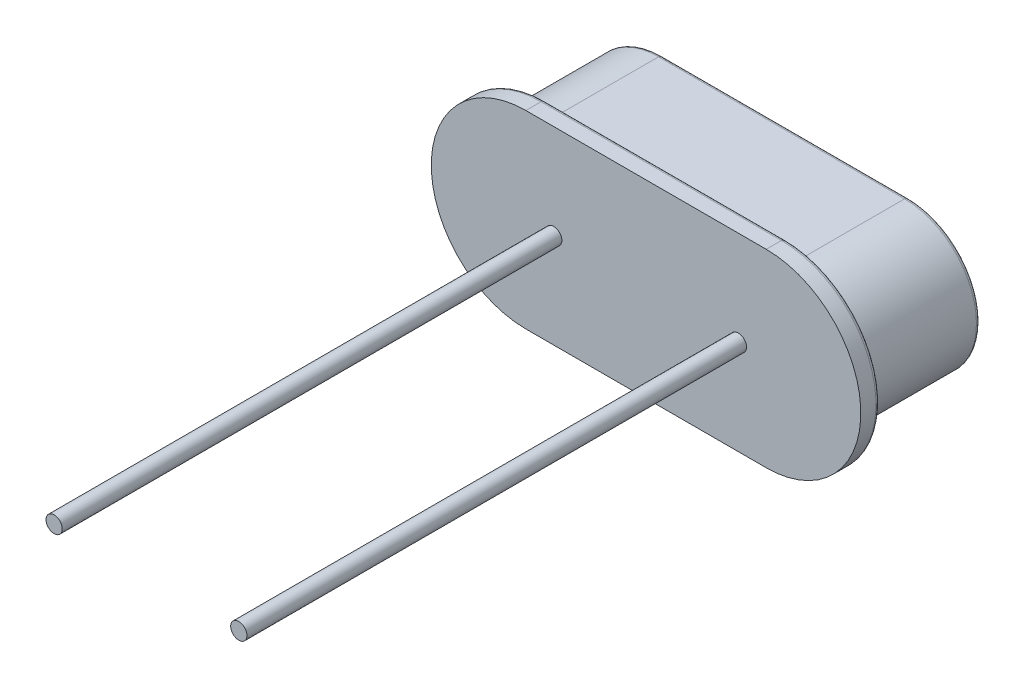
ISO-10303-21;
HEADER;
FILE_DESCRIPTION(('STEP AP214'),'2;1');
FILE_NAME('part.step','',(''),(''),'','','');
FILE_SCHEMA(('AUTOMOTIVE_DESIGN { 1 0 10303 214 1 1 1 1 }'));
ENDSEC;
DATA;
#1=APPLICATION_CONTEXT('core data for automotive mechanical design processes');
#2=APPLICATION_PROTOCOL_DEFINITION('international standard','automotive_design',2000,#1);
#3=PRODUCT_CONTEXT('',#1,'mechanical');
#4=PRODUCT('Part','Part','',(#3));
#5=PRODUCT_RELATED_PRODUCT_CATEGORY('part','',(#4));
#6=PRODUCT_DEFINITION_FORMATION('','',#4);
#7=PRODUCT_DEFINITION_CONTEXT('part definition',#1,'design');
#8=PRODUCT_DEFINITION('design','',#6,#7);
#9=PRODUCT_DEFINITION_SHAPE('','',#8);
#10=(LENGTH_UNIT() NAMED_UNIT(*) SI_UNIT(.MILLI.,.METRE.));
#11=(NAMED_UNIT(*) PLANE_ANGLE_UNIT() SI_UNIT($,.RADIAN.));
#12=(NAMED_UNIT(*) SI_UNIT($,.STERADIAN.) SOLID_ANGLE_UNIT());
#13=UNCERTAINTY_MEASURE_WITH_UNIT(LENGTH_MEASURE(1.E-05),#10,'distance_accuracy_value','');
#14=(GEOMETRIC_REPRESENTATION_CONTEXT(3) GLOBAL_UNCERTAINTY_ASSIGNED_CONTEXT((#13)) GLOBAL_UNIT_ASSIGNED_CONTEXT((#10,
#11,#12)) REPRESENTATION_CONTEXT('',''));
#15=CARTESIAN_POINT('',(0.,0.,0.));
#16=DIRECTION('',(0.,0.,1.));
#17=DIRECTION('',(1.,0.,0.));
#18=AXIS2_PLACEMENT_3D('',#15,#16,#17);
#19=CARTESIAN_POINT('',(-3.175,0.,0.));
#20=DIRECTION('',(0.,0.,1.));
#21=DIRECTION('',(1.,0.,0.));
#22=AXIS2_PLACEMENT_3D('',#19,#20,#21);
#23=PLANE('',#22);
#24=CARTESIAN_POINT('',(-2.44,0.,0.));
#25=DIRECTION('',(0.,0.,1.));
#26=DIRECTION('',(1.,0.,0.));
#27=AXIS2_PLACEMENT_3D('',#24,#25,#26);
#28=CIRCLE('',#27,0.215);
#29=CARTESIAN_POINT('',(-2.225,0.,0.));
#30=VERTEX_POINT('',#29);
#31=EDGE_CURVE('E314',#30,#30,#28,.T.);
#32=ORIENTED_EDGE('',*,*,#31,.F.);
#33=EDGE_LOOP('',(#32));
#34=FACE_BOUND('',#33,.T.);
#35=CARTESIAN_POINT('',(-3.175,0.,0.));
#36=DIRECTION('',(0.,0.,1.));
#37=DIRECTION('',(1.,0.,0.));
#38=AXIS2_PLACEMENT_3D('',#35,#36,#37);
#39=CIRCLE('',#38,2.5);
#40=CARTESIAN_POINT('',(-3.175,2.5,0.));
#41=VERTEX_POINT('',#40);
#42=CARTESIAN_POINT('',(-3.175,-2.5,0.));
#43=VERTEX_POINT('',#42);
#44=EDGE_CURVE('E156',#41,#43,#39,.T.);
#45=ORIENTED_EDGE('',*,*,#44,.T.);
#46=DIRECTION('',(1.,0.,0.));
#47=VECTOR('',#46,1.);
#48=CARTESIAN_POINT('',(-3.175,-2.5,0.));
#49=LINE('',#48,#47);
#50=CARTESIAN_POINT('',(3.175,-2.5,0.));
#51=VERTEX_POINT('',#50);
#52=EDGE_CURVE('E159',#43,#51,#49,.T.);
#53=ORIENTED_EDGE('',*,*,#52,.T.);
#54=CARTESIAN_POINT('',(3.175,0.,0.));
#55=DIRECTION('',(0.,0.,1.));
#56=DIRECTION('',(1.,0.,0.));
#57=AXIS2_PLACEMENT_3D('',#54,#55,#56);
#58=CIRCLE('',#57,2.5);
#59=CARTESIAN_POINT('',(3.175,2.5,0.));
#60=VERTEX_POINT('',#59);
#61=EDGE_CURVE('E162',#51,#60,#58,.T.);
#62=ORIENTED_EDGE('',*,*,#61,.T.);
#63=DIRECTION('',(-1.,0.,0.));
#64=VECTOR('',#63,1.);
#65=CARTESIAN_POINT('',(-3.175,2.5,0.));
#66=LINE('',#65,#64);
#67=EDGE_CURVE('E165',#60,#41,#66,.T.);
#68=ORIENTED_EDGE('',*,*,#67,.T.);
#69=EDGE_LOOP('',(#45,#53,#62,#68));
#70=FACE_BOUND('',#69,.T.);
#71=CARTESIAN_POINT('',(2.44,0.,0.));
#72=DIRECTION('',(0.,0.,1.));
#73=DIRECTION('',(1.,0.,0.));
#74=AXIS2_PLACEMENT_3D('',#71,#72,#73);
#75=CIRCLE('',#74,0.215);
#76=CARTESIAN_POINT('',(2.655,0.,0.));
#77=VERTEX_POINT('',#76);
#78=EDGE_CURVE('E204',#77,#77,#75,.T.);
#79=ORIENTED_EDGE('',*,*,#78,.F.);
#80=EDGE_LOOP('',(#79));
#81=FACE_BOUND('',#80,.T.);
#82=ADVANCED_FACE('F32',(#34,#70,#81),#23,.T.);
#83=CARTESIAN_POINT('',(-3.175,0.,-0.5));
#84=DIRECTION('',(0.,0.,1.));
#85=DIRECTION('',(1.,0.,0.));
#86=AXIS2_PLACEMENT_3D('',#83,#84,#85);
#87=PLANE('',#86);
#88=CARTESIAN_POINT('',(3.175,0.,-0.5));
#89=DIRECTION('',(0.,0.,1.));
#90=DIRECTION('',(1.,0.,0.));
#91=AXIS2_PLACEMENT_3D('',#88,#89,#90);
#92=CIRCLE('',#91,2.4);
#93=CARTESIAN_POINT('',(3.175,2.4,-0.5));
#94=VERTEX_POINT('',#93);
#95=CARTESIAN_POINT('',(3.175,-2.4,-0.5));
#96=VERTEX_POINT('',#95);
#97=EDGE_CURVE('E207',#94,#96,#92,.F.);
#98=ORIENTED_EDGE('',*,*,#97,.T.);
#99=DIRECTION('',(1.,0.,0.));
#100=VECTOR('',#99,1.);
#101=CARTESIAN_POINT('',(-3.175,-2.4,-0.5));
#102=LINE('',#101,#100);
#103=CARTESIAN_POINT('',(-3.175,-2.4,-0.5));
#104=VERTEX_POINT('',#103);
#105=EDGE_CURVE('E213',#96,#104,#102,.F.);
#106=ORIENTED_EDGE('',*,*,#105,.T.);
#107=CARTESIAN_POINT('',(-3.175,0.,-0.5));
#108=DIRECTION('',(0.,0.,1.));
#109=DIRECTION('',(1.,0.,0.));
#110=AXIS2_PLACEMENT_3D('',#107,#108,#109);
#111=CIRCLE('',#110,2.4);
#112=CARTESIAN_POINT('',(-3.175,2.4,-0.5));
#113=VERTEX_POINT('',#112);
#114=EDGE_CURVE('E211',#104,#113,#111,.F.);
#115=ORIENTED_EDGE('',*,*,#114,.T.);
#116=DIRECTION('',(-1.,0.,0.));
#117=VECTOR('',#116,1.);
#118=CARTESIAN_POINT('',(3.175,2.4,-0.5));
#119=LINE('',#118,#117);
#120=EDGE_CURVE('E209',#113,#94,#119,.F.);
#121=ORIENTED_EDGE('',*,*,#120,.T.);
#122=EDGE_LOOP('',(#98,#106,#115,#121));
#123=FACE_BOUND('',#122,.T.);
#124=CARTESIAN_POINT('',(3.25,0.,-0.5));
#125=DIRECTION('',(0.,0.,-1.));
#126=DIRECTION('',(-1.,0.,0.));
#127=AXIS2_PLACEMENT_3D('',#124,#125,#126);
#128=CIRCLE('',#127,1.9);
#129=CARTESIAN_POINT('',(3.25,1.9,-0.5));
#130=VERTEX_POINT('',#129);
#131=CARTESIAN_POINT('',(3.25,-1.9,-0.5));
#132=VERTEX_POINT('',#131);
#133=EDGE_CURVE('E125',#130,#132,#128,.T.);
#134=ORIENTED_EDGE('',*,*,#133,.F.);
#135=DIRECTION('',(1.,0.,0.));
#136=VECTOR('',#135,1.);
#137=CARTESIAN_POINT('',(3.25,1.9,-0.5));
#138=LINE('',#137,#136);
#139=CARTESIAN_POINT('',(-3.25,1.9,-0.5));
#140=VERTEX_POINT('',#139);
#141=EDGE_CURVE('E132',#140,#130,#138,.T.);
#142=ORIENTED_EDGE('',*,*,#141,.F.);
#143=CARTESIAN_POINT('',(-3.25,0.,-0.5));
#144=DIRECTION('',(0.,0.,-1.));
#145=DIRECTION('',(-1.,0.,0.));
#146=AXIS2_PLACEMENT_3D('',#143,#144,#145);
#147=CIRCLE('',#146,1.9);
#148=CARTESIAN_POINT('',(-3.25,-1.9,-0.5));
#149=VERTEX_POINT('',#148);
#150=EDGE_CURVE('E146',#149,#140,#147,.T.);
#151=ORIENTED_EDGE('',*,*,#150,.F.);
#152=DIRECTION('',(-1.,0.,0.));
#153=VECTOR('',#152,1.);
#154=CARTESIAN_POINT('',(3.25,-1.9,-0.5));
#155=LINE('',#154,#153);
#156=EDGE_CURVE('E141',#132,#149,#155,.T.);
#157=ORIENTED_EDGE('',*,*,#156,.F.);
#158=EDGE_LOOP('',(#134,#142,#151,#157));
#159=FACE_BOUND('',#158,.T.);
#160=ADVANCED_FACE('F137',(#123,#159),#87,.F.);
#161=CARTESIAN_POINT('',(-3.175,0.,-0.5));
#162=DIRECTION('',(0.,0.,1.));
#163=DIRECTION('',(1.,0.,0.));
#164=AXIS2_PLACEMENT_3D('',#161,#162,#163);
#165=CYLINDRICAL_SURFACE('',#164,2.5);
#166=DIRECTION('',(0.,0.,1.));
#167=VECTOR('',#166,1.);
#168=CARTESIAN_POINT('',(-3.175,2.5,-0.5));
#169=LINE('',#168,#167);
#170=CARTESIAN_POINT('',(-3.175,2.5,-0.4));
#171=VERTEX_POINT('',#170);
#172=EDGE_CURVE('E169',#171,#41,#169,.T.);
#173=ORIENTED_EDGE('',*,*,#172,.F.);
#174=CARTESIAN_POINT('',(-3.175,0.,-0.4));
#175=DIRECTION('',(0.,0.,1.));
#176=DIRECTION('',(1.,0.,0.));
#177=AXIS2_PLACEMENT_3D('',#174,#175,#176);
#178=CIRCLE('',#177,2.5);
#179=CARTESIAN_POINT('',(-3.175,-2.5,-0.4));
#180=VERTEX_POINT('',#179);
#181=EDGE_CURVE('E216',#171,#180,#178,.T.);
#182=ORIENTED_EDGE('',*,*,#181,.T.);
#183=DIRECTION('',(0.,0.,1.));
#184=VECTOR('',#183,1.);
#185=CARTESIAN_POINT('',(-3.175,-2.5,-0.5));
#186=LINE('',#185,#184);
#187=EDGE_CURVE('E168',#180,#43,#186,.T.);
#188=ORIENTED_EDGE('',*,*,#187,.T.);
#189=ORIENTED_EDGE('',*,*,#44,.F.);
#190=EDGE_LOOP('',(#173,#182,#188,#189));
#191=FACE_BOUND('',#190,.T.);
#192=ADVANCED_FACE('F254',(#191),#165,.T.);
#193=CARTESIAN_POINT('',(-3.175,2.5,-0.5));
#194=DIRECTION('',(0.,1.,0.));
#195=DIRECTION('',(-1.,0.,0.));
#196=AXIS2_PLACEMENT_3D('',#193,#194,#195);
#197=PLANE('',#196);
#198=DIRECTION('',(0.,0.,1.));
#199=VECTOR('',#198,1.);
#200=CARTESIAN_POINT('',(3.175,2.5,-0.5));
#201=LINE('',#200,#199);
#202=CARTESIAN_POINT('',(3.175,2.5,-0.4));
#203=VERTEX_POINT('',#202);
#204=EDGE_CURVE('E172',#203,#60,#201,.T.);
#205=ORIENTED_EDGE('',*,*,#204,.F.);
#206=DIRECTION('',(-1.,0.,0.));
#207=VECTOR('',#206,1.);
#208=CARTESIAN_POINT('',(-3.175,2.5,-0.4));
#209=LINE('',#208,#207);
#210=EDGE_CURVE('E41',#203,#171,#209,.T.);
#211=ORIENTED_EDGE('',*,*,#210,.T.);
#212=ORIENTED_EDGE('',*,*,#172,.T.);
#213=ORIENTED_EDGE('',*,*,#67,.F.);
#214=EDGE_LOOP('',(#205,#211,#212,#213));
#215=FACE_BOUND('',#214,.T.);
#216=ADVANCED_FACE('F255',(#215),#197,.T.);
#217=CARTESIAN_POINT('',(3.175,0.,-0.5));
#218=DIRECTION('',(0.,0.,1.));
#219=DIRECTION('',(1.,0.,0.));
#220=AXIS2_PLACEMENT_3D('',#217,#218,#219);
#221=CYLINDRICAL_SURFACE('',#220,2.5);
#222=DIRECTION('',(0.,0.,1.));
#223=VECTOR('',#222,1.);
#224=CARTESIAN_POINT('',(3.175,-2.5,-0.5));
#225=LINE('',#224,#223);
#226=CARTESIAN_POINT('',(3.175,-2.5,-0.4));
#227=VERTEX_POINT('',#226);
#228=EDGE_CURVE('E174',#227,#51,#225,.T.);
#229=ORIENTED_EDGE('',*,*,#228,.F.);
#230=CARTESIAN_POINT('',(3.175,0.,-0.4));
#231=DIRECTION('',(0.,0.,1.));
#232=DIRECTION('',(1.,0.,0.));
#233=AXIS2_PLACEMENT_3D('',#230,#231,#232);
#234=CIRCLE('',#233,2.5);
#235=EDGE_CURVE('E11',#227,#203,#234,.T.);
#236=ORIENTED_EDGE('',*,*,#235,.T.);
#237=ORIENTED_EDGE('',*,*,#204,.T.);
#238=ORIENTED_EDGE('',*,*,#61,.F.);
#239=EDGE_LOOP('',(#229,#236,#237,#238));
#240=FACE_BOUND('',#239,.T.);
#241=ADVANCED_FACE('F248',(#240),#221,.T.);
#242=CARTESIAN_POINT('',(-3.175,-2.5,-0.5));
#243=DIRECTION('',(0.,-1.,0.));
#244=DIRECTION('',(1.,0.,0.));
#245=AXIS2_PLACEMENT_3D('',#242,#243,#244);
#246=PLANE('',#245);
#247=ORIENTED_EDGE('',*,*,#187,.F.);
#248=DIRECTION('',(1.,0.,0.));
#249=VECTOR('',#248,1.);
#250=CARTESIAN_POINT('',(3.175,-2.5,-0.4));
#251=LINE('',#250,#249);
#252=EDGE_CURVE('E193',#180,#227,#251,.T.);
#253=ORIENTED_EDGE('',*,*,#252,.T.);
#254=ORIENTED_EDGE('',*,*,#228,.T.);
#255=ORIENTED_EDGE('',*,*,#52,.F.);
#256=EDGE_LOOP('',(#247,#253,#254,#255));
#257=FACE_BOUND('',#256,.T.);
#258=ADVANCED_FACE('F245',(#257),#246,.T.);
#259=CARTESIAN_POINT('',(3.25,0.,-3.68));
#260=DIRECTION('',(0.,0.,1.));
#261=DIRECTION('',(1.,0.,0.));
#262=AXIS2_PLACEMENT_3D('',#259,#260,#261);
#263=CYLINDRICAL_SURFACE('',#262,1.9);
#264=DIRECTION('',(0.,0.,1.));
#265=VECTOR('',#264,1.);
#266=CARTESIAN_POINT('',(3.25,-1.9,-3.68));
#267=LINE('',#266,#265);
#268=CARTESIAN_POINT('',(3.25,-1.9,-3.58));
#269=VERTEX_POINT('',#268);
#270=EDGE_CURVE('E154',#269,#132,#267,.T.);
#271=ORIENTED_EDGE('',*,*,#270,.F.);
#272=CARTESIAN_POINT('',(3.25,0.,-3.58));
#273=DIRECTION('',(0.,0.,-1.));
#274=DIRECTION('',(-1.,0.,0.));
#275=AXIS2_PLACEMENT_3D('',#272,#273,#274);
#276=CIRCLE('',#275,1.9);
#277=CARTESIAN_POINT('',(3.25,1.9,-3.58));
#278=VERTEX_POINT('',#277);
#279=EDGE_CURVE('E127',#269,#278,#276,.F.);
#280=ORIENTED_EDGE('',*,*,#279,.T.);
#281=DIRECTION('',(0.,0.,1.));
#282=VECTOR('',#281,1.);
#283=CARTESIAN_POINT('',(3.25,1.9,-3.68));
#284=LINE('',#283,#282);
#285=EDGE_CURVE('E121',#278,#130,#284,.T.);
#286=ORIENTED_EDGE('',*,*,#285,.T.);
#287=ORIENTED_EDGE('',*,*,#133,.T.);
#288=EDGE_LOOP('',(#271,#280,#286,#287));
#289=FACE_BOUND('',#288,.T.);
#290=ADVANCED_FACE('F124',(#289),#263,.T.);
#291=CARTESIAN_POINT('',(3.25,-1.9,-3.68));
#292=DIRECTION('',(0.,1.,0.));
#293=DIRECTION('',(-1.,0.,0.));
#294=AXIS2_PLACEMENT_3D('',#291,#292,#293);
#295=PLANE('',#294);
#296=DIRECTION('',(0.,0.,1.));
#297=VECTOR('',#296,1.);
#298=CARTESIAN_POINT('',(-3.25,-1.9,-3.68));
#299=LINE('',#298,#297);
#300=CARTESIAN_POINT('',(-3.25,-1.9,-3.58));
#301=VERTEX_POINT('',#300);
#302=EDGE_CURVE('E152',#301,#149,#299,.T.);
#303=ORIENTED_EDGE('',*,*,#302,.F.);
#304=DIRECTION('',(-1.,0.,0.));
#305=VECTOR('',#304,1.);
#306=CARTESIAN_POINT('',(3.25,-1.9,-3.58));
#307=LINE('',#306,#305);
#308=EDGE_CURVE('E188',#301,#269,#307,.F.);
#309=ORIENTED_EDGE('',*,*,#308,.T.);
#310=ORIENTED_EDGE('',*,*,#270,.T.);
#311=ORIENTED_EDGE('',*,*,#156,.T.);
#312=EDGE_LOOP('',(#303,#309,#310,#311));
#313=FACE_BOUND('',#312,.T.);
#314=ADVANCED_FACE('F275',(#313),#295,.F.);
#315=CARTESIAN_POINT('',(-3.25,0.,-3.68));
#316=DIRECTION('',(0.,0.,1.));
#317=DIRECTION('',(1.,0.,0.));
#318=AXIS2_PLACEMENT_3D('',#315,#316,#317);
#319=CYLINDRICAL_SURFACE('',#318,1.9);
#320=DIRECTION('',(0.,0.,1.));
#321=VECTOR('',#320,1.);
#322=CARTESIAN_POINT('',(-3.25,1.9,-3.68));
#323=LINE('',#322,#321);
#324=CARTESIAN_POINT('',(-3.25,1.9,-3.58));
#325=VERTEX_POINT('',#324);
#326=EDGE_CURVE('E131',#325,#140,#323,.T.);
#327=ORIENTED_EDGE('',*,*,#326,.F.);
#328=CARTESIAN_POINT('',(-3.25,0.,-3.58));
#329=DIRECTION('',(0.,0.,-1.));
#330=DIRECTION('',(-1.,0.,0.));
#331=AXIS2_PLACEMENT_3D('',#328,#329,#330);
#332=CIRCLE('',#331,1.9);
#333=EDGE_CURVE('E185',#325,#301,#332,.F.);
#334=ORIENTED_EDGE('',*,*,#333,.T.);
#335=ORIENTED_EDGE('',*,*,#302,.T.);
#336=ORIENTED_EDGE('',*,*,#150,.T.);
#337=EDGE_LOOP('',(#327,#334,#335,#336));
#338=FACE_BOUND('',#337,.T.);
#339=ADVANCED_FACE('F278',(#338),#319,.T.);
#340=CARTESIAN_POINT('',(3.25,1.9,-3.68));
#341=DIRECTION('',(0.,-1.,0.));
#342=DIRECTION('',(1.,0.,0.));
#343=AXIS2_PLACEMENT_3D('',#340,#341,#342);
#344=PLANE('',#343);
#345=ORIENTED_EDGE('',*,*,#285,.F.);
#346=DIRECTION('',(1.,0.,0.));
#347=VECTOR('',#346,1.);
#348=CARTESIAN_POINT('',(-3.25,1.9,-3.58));
#349=LINE('',#348,#347);
#350=EDGE_CURVE('E191',#278,#325,#349,.F.);
#351=ORIENTED_EDGE('',*,*,#350,.T.);
#352=ORIENTED_EDGE('',*,*,#326,.T.);
#353=ORIENTED_EDGE('',*,*,#141,.T.);
#354=EDGE_LOOP('',(#345,#351,#352,#353));
#355=FACE_BOUND('',#354,.T.);
#356=ADVANCED_FACE('F144',(#355),#344,.F.);
#357=CARTESIAN_POINT('',(3.25,0.,-3.68));
#358=DIRECTION('',(0.,0.,-1.));
#359=DIRECTION('',(-1.,0.,0.));
#360=AXIS2_PLACEMENT_3D('',#357,#358,#359);
#361=PLANE('',#360);
#362=DIRECTION('',(-1.,0.,0.));
#363=VECTOR('',#362,1.);
#364=CARTESIAN_POINT('',(-3.25,-1.8,-3.68));
#365=LINE('',#364,#363);
#366=CARTESIAN_POINT('',(3.25,-1.8,-3.68));
#367=VERTEX_POINT('',#366);
#368=CARTESIAN_POINT('',(-3.25,-1.8,-3.68));
#369=VERTEX_POINT('',#368);
#370=EDGE_CURVE('E180',#367,#369,#365,.T.);
#371=ORIENTED_EDGE('',*,*,#370,.T.);
#372=CARTESIAN_POINT('',(-3.25,0.,-3.68));
#373=DIRECTION('',(0.,0.,-1.));
#374=DIRECTION('',(-1.,0.,0.));
#375=AXIS2_PLACEMENT_3D('',#372,#373,#374);
#376=CIRCLE('',#375,1.8);
#377=CARTESIAN_POINT('',(-3.25,1.8,-3.68));
#378=VERTEX_POINT('',#377);
#379=EDGE_CURVE('E182',#369,#378,#376,.T.);
#380=ORIENTED_EDGE('',*,*,#379,.T.);
#381=DIRECTION('',(1.,0.,0.));
#382=VECTOR('',#381,1.);
#383=CARTESIAN_POINT('',(3.25,1.8,-3.68));
#384=LINE('',#383,#382);
#385=CARTESIAN_POINT('',(3.25,1.8,-3.68));
#386=VERTEX_POINT('',#385);
#387=EDGE_CURVE('E171',#378,#386,#384,.T.);
#388=ORIENTED_EDGE('',*,*,#387,.T.);
#389=CARTESIAN_POINT('',(3.25,0.,-3.68));
#390=DIRECTION('',(0.,0.,-1.));
#391=DIRECTION('',(-1.,0.,0.));
#392=AXIS2_PLACEMENT_3D('',#389,#390,#391);
#393=CIRCLE('',#392,1.8);
#394=EDGE_CURVE('E178',#386,#367,#393,.T.);
#395=ORIENTED_EDGE('',*,*,#394,.T.);
#396=EDGE_LOOP('',(#371,#380,#388,#395));
#397=FACE_BOUND('',#396,.T.);
#398=ADVANCED_FACE('F285',(#397),#361,.T.);
#399=CARTESIAN_POINT('',(-2.44,0.,13.2));
#400=DIRECTION('',(0.,0.,-1.));
#401=DIRECTION('',(-1.,0.,0.));
#402=AXIS2_PLACEMENT_3D('',#399,#400,#401);
#403=CYLINDRICAL_SURFACE('',#402,0.215);
#404=CARTESIAN_POINT('',(-2.44,0.,13.2));
#405=DIRECTION('',(0.,0.,1.));
#406=DIRECTION('',(1.,0.,0.));
#407=AXIS2_PLACEMENT_3D('',#404,#405,#406);
#408=CIRCLE('',#407,0.215);
#409=CARTESIAN_POINT('',(-2.225,0.,13.2));
#410=VERTEX_POINT('',#409);
#411=EDGE_CURVE('E142',#410,#410,#408,.T.);
#412=ORIENTED_EDGE('',*,*,#411,.F.);
#413=EDGE_LOOP('',(#412));
#414=FACE_BOUND('',#413,.T.);
#415=ORIENTED_EDGE('',*,*,#31,.T.);
#416=EDGE_LOOP('',(#415));
#417=FACE_BOUND('',#416,.T.);
#418=ADVANCED_FACE('F288',(#414,#417),#403,.T.);
#419=CARTESIAN_POINT('',(-2.44,0.,13.2));
#420=DIRECTION('',(0.,0.,1.));
#421=DIRECTION('',(1.,0.,0.));
#422=AXIS2_PLACEMENT_3D('',#419,#420,#421);
#423=PLANE('',#422);
#424=ORIENTED_EDGE('',*,*,#411,.T.);
#425=EDGE_LOOP('',(#424));
#426=FACE_BOUND('',#425,.T.);
#427=ADVANCED_FACE('F292',(#426),#423,.T.);
#428=CARTESIAN_POINT('',(2.44,0.,13.2));
#429=DIRECTION('',(0.,0.,-1.));
#430=DIRECTION('',(-1.,0.,0.));
#431=AXIS2_PLACEMENT_3D('',#428,#429,#430);
#432=CYLINDRICAL_SURFACE('',#431,0.215);
#433=CARTESIAN_POINT('',(2.44,0.,13.2));
#434=DIRECTION('',(0.,0.,1.));
#435=DIRECTION('',(1.,0.,0.));
#436=AXIS2_PLACEMENT_3D('',#433,#434,#435);
#437=CIRCLE('',#436,0.215);
#438=CARTESIAN_POINT('',(2.655,0.,13.2));
#439=VERTEX_POINT('',#438);
#440=EDGE_CURVE('E313',#439,#439,#437,.T.);
#441=ORIENTED_EDGE('',*,*,#440,.F.);
#442=EDGE_LOOP('',(#441));
#443=FACE_BOUND('',#442,.T.);
#444=ORIENTED_EDGE('',*,*,#78,.T.);
#445=EDGE_LOOP('',(#444));
#446=FACE_BOUND('',#445,.T.);
#447=ADVANCED_FACE('F296',(#443,#446),#432,.T.);
#448=CARTESIAN_POINT('',(2.44,0.,13.2));
#449=DIRECTION('',(0.,0.,1.));
#450=DIRECTION('',(1.,0.,0.));
#451=AXIS2_PLACEMENT_3D('',#448,#449,#450);
#452=PLANE('',#451);
#453=ORIENTED_EDGE('',*,*,#440,.T.);
#454=EDGE_LOOP('',(#453));
#455=FACE_BOUND('',#454,.T.);
#456=ADVANCED_FACE('F300',(#455),#452,.T.);
#457=CARTESIAN_POINT('',(3.25,0.,-3.58));
#458=DIRECTION('',(0.,0.,-1.));
#459=DIRECTION('',(-1.,0.,0.));
#460=AXIS2_PLACEMENT_3D('',#457,#458,#459);
#461=TOROIDAL_SURFACE('',#460,1.8,0.1);
#462=CARTESIAN_POINT('',(3.25,1.8,-3.58));
#463=DIRECTION('',(-1.,0.,0.));
#464=DIRECTION('',(0.,0.,1.));
#465=AXIS2_PLACEMENT_3D('',#462,#463,#464);
#466=CIRCLE('',#465,0.1);
#467=EDGE_CURVE('E198',#278,#386,#466,.T.);
#468=ORIENTED_EDGE('',*,*,#467,.F.);
#469=ORIENTED_EDGE('',*,*,#279,.F.);
#470=CARTESIAN_POINT('',(3.25,-1.8,-3.58));
#471=DIRECTION('',(-1.,0.,0.));
#472=DIRECTION('',(0.,0.,1.));
#473=AXIS2_PLACEMENT_3D('',#470,#471,#472);
#474=CIRCLE('',#473,0.1);
#475=EDGE_CURVE('E201',#367,#269,#474,.T.);
#476=ORIENTED_EDGE('',*,*,#475,.F.);
#477=ORIENTED_EDGE('',*,*,#394,.F.);
#478=EDGE_LOOP('',(#468,#469,#476,#477));
#479=FACE_BOUND('',#478,.T.);
#480=ADVANCED_FACE('F303',(#479),#461,.T.);
#481=CARTESIAN_POINT('',(3.25,-1.8,-3.58));
#482=DIRECTION('',(1.,0.,0.));
#483=DIRECTION('',(0.,1.,0.));
#484=AXIS2_PLACEMENT_3D('',#481,#482,#483);
#485=CYLINDRICAL_SURFACE('',#484,0.1);
#486=ORIENTED_EDGE('',*,*,#475,.T.);
#487=ORIENTED_EDGE('',*,*,#308,.F.);
#488=CARTESIAN_POINT('',(-3.25,-1.8,-3.58));
#489=DIRECTION('',(-1.,0.,0.));
#490=DIRECTION('',(0.,0.,1.));
#491=AXIS2_PLACEMENT_3D('',#488,#489,#490);
#492=CIRCLE('',#491,0.1);
#493=EDGE_CURVE('E196',#369,#301,#492,.T.);
#494=ORIENTED_EDGE('',*,*,#493,.F.);
#495=ORIENTED_EDGE('',*,*,#370,.F.);
#496=EDGE_LOOP('',(#486,#487,#494,#495));
#497=FACE_BOUND('',#496,.T.);
#498=ADVANCED_FACE('F308',(#497),#485,.T.);
#499=CARTESIAN_POINT('',(3.25,1.8,-3.58));
#500=DIRECTION('',(-1.,0.,0.));
#501=DIRECTION('',(0.,-1.,0.));
#502=AXIS2_PLACEMENT_3D('',#499,#500,#501);
#503=CYLINDRICAL_SURFACE('',#502,0.1);
#504=ORIENTED_EDGE('',*,*,#467,.T.);
#505=ORIENTED_EDGE('',*,*,#387,.F.);
#506=CARTESIAN_POINT('',(-3.25,1.8,-3.58));
#507=DIRECTION('',(-1.,0.,0.));
#508=DIRECTION('',(0.,0.,1.));
#509=AXIS2_PLACEMENT_3D('',#506,#507,#508);
#510=CIRCLE('',#509,0.1);
#511=EDGE_CURVE('E194',#325,#378,#510,.T.);
#512=ORIENTED_EDGE('',*,*,#511,.F.);
#513=ORIENTED_EDGE('',*,*,#350,.F.);
#514=EDGE_LOOP('',(#504,#505,#512,#513));
#515=FACE_BOUND('',#514,.T.);
#516=ADVANCED_FACE('F333',(#515),#503,.T.);
#517=CARTESIAN_POINT('',(-3.25,0.,-3.58));
#518=DIRECTION('',(0.,0.,-1.));
#519=DIRECTION('',(-1.,0.,0.));
#520=AXIS2_PLACEMENT_3D('',#517,#518,#519);
#521=TOROIDAL_SURFACE('',#520,1.8,0.1);
#522=ORIENTED_EDGE('',*,*,#493,.T.);
#523=ORIENTED_EDGE('',*,*,#333,.F.);
#524=ORIENTED_EDGE('',*,*,#511,.T.);
#525=ORIENTED_EDGE('',*,*,#379,.F.);
#526=EDGE_LOOP('',(#522,#523,#524,#525));
#527=FACE_BOUND('',#526,.T.);
#528=ADVANCED_FACE('F337',(#527),#521,.T.);
#529=CARTESIAN_POINT('',(-3.175,2.4,-0.4));
#530=DIRECTION('',(1.,0.,0.));
#531=DIRECTION('',(0.,1.,0.));
#532=AXIS2_PLACEMENT_3D('',#529,#530,#531);
#533=CYLINDRICAL_SURFACE('',#532,0.1);
#534=CARTESIAN_POINT('',(3.175,2.4,-0.4));
#535=DIRECTION('',(1.,0.,0.));
#536=DIRECTION('',(0.,0.,-1.));
#537=AXIS2_PLACEMENT_3D('',#534,#535,#536);
#538=CIRCLE('',#537,0.1);
#539=EDGE_CURVE('E222',#94,#203,#538,.T.);
#540=ORIENTED_EDGE('',*,*,#539,.F.);
#541=ORIENTED_EDGE('',*,*,#120,.F.);
#542=CARTESIAN_POINT('',(-3.175,2.4,-0.4));
#543=DIRECTION('',(-1.,0.,0.));
#544=DIRECTION('',(0.,0.,1.));
#545=AXIS2_PLACEMENT_3D('',#542,#543,#544);
#546=CIRCLE('',#545,0.1);
#547=EDGE_CURVE('E36',#171,#113,#546,.T.);
#548=ORIENTED_EDGE('',*,*,#547,.F.);
#549=ORIENTED_EDGE('',*,*,#210,.F.);
#550=EDGE_LOOP('',(#540,#541,#548,#549));
#551=FACE_BOUND('',#550,.T.);
#552=ADVANCED_FACE('F34',(#551),#533,.T.);
#553=CARTESIAN_POINT('',(-3.175,0.,-0.4));
#554=DIRECTION('',(0.,0.,1.));
#555=DIRECTION('',(1.,0.,0.));
#556=AXIS2_PLACEMENT_3D('',#553,#554,#555);
#557=TOROIDAL_SURFACE('',#556,2.4,0.1);
#558=ORIENTED_EDGE('',*,*,#547,.T.);
#559=ORIENTED_EDGE('',*,*,#114,.F.);
#560=CARTESIAN_POINT('',(-3.175,-2.4,-0.4));
#561=DIRECTION('',(1.,0.,0.));
#562=DIRECTION('',(0.,0.,-1.));
#563=AXIS2_PLACEMENT_3D('',#560,#561,#562);
#564=CIRCLE('',#563,0.1);
#565=EDGE_CURVE('E221',#180,#104,#564,.T.);
#566=ORIENTED_EDGE('',*,*,#565,.F.);
#567=ORIENTED_EDGE('',*,*,#181,.F.);
#568=EDGE_LOOP('',(#558,#559,#566,#567));
#569=FACE_BOUND('',#568,.T.);
#570=ADVANCED_FACE('F232',(#569),#557,.T.);
#571=CARTESIAN_POINT('',(3.175,0.,-0.4));
#572=DIRECTION('',(0.,0.,1.));
#573=DIRECTION('',(1.,0.,0.));
#574=AXIS2_PLACEMENT_3D('',#571,#572,#573);
#575=TOROIDAL_SURFACE('',#574,2.4,0.1);
#576=ORIENTED_EDGE('',*,*,#539,.T.);
#577=ORIENTED_EDGE('',*,*,#235,.F.);
#578=CARTESIAN_POINT('',(3.175,-2.4,-0.4));
#579=DIRECTION('',(-1.,0.,0.));
#580=DIRECTION('',(0.,0.,1.));
#581=AXIS2_PLACEMENT_3D('',#578,#579,#580);
#582=CIRCLE('',#581,0.1);
#583=EDGE_CURVE('E219',#96,#227,#582,.T.);
#584=ORIENTED_EDGE('',*,*,#583,.F.);
#585=ORIENTED_EDGE('',*,*,#97,.F.);
#586=EDGE_LOOP('',(#576,#577,#584,#585));
#587=FACE_BOUND('',#586,.T.);
#588=ADVANCED_FACE('F242',(#587),#575,.T.);
#589=CARTESIAN_POINT('',(-3.175,-2.4,-0.4));
#590=DIRECTION('',(-1.,0.,0.));
#591=DIRECTION('',(0.,-1.,0.));
#592=AXIS2_PLACEMENT_3D('',#589,#590,#591);
#593=CYLINDRICAL_SURFACE('',#592,0.1);
#594=ORIENTED_EDGE('',*,*,#565,.T.);
#595=ORIENTED_EDGE('',*,*,#105,.F.);
#596=ORIENTED_EDGE('',*,*,#583,.T.);
#597=ORIENTED_EDGE('',*,*,#252,.F.);
#598=EDGE_LOOP('',(#594,#595,#596,#597));
#599=FACE_BOUND('',#598,.T.);
#600=ADVANCED_FACE('F240',(#599),#593,.T.);
#601=CLOSED_SHELL('',(#82,#160,#192,#216,#241,#258,#290,#314,#339,#356,#398,#418,#427,#447,#456,
#480,#498,#516,#528,#552,#570,#588,#600));
#602=MANIFOLD_SOLID_BREP('B2',#601);
#603=ADVANCED_BREP_SHAPE_REPRESENTATION('',(#18,#602),#14);
#604=SHAPE_DEFINITION_REPRESENTATION(#9,#603);
ENDSEC;
END-ISO-10303-21;
